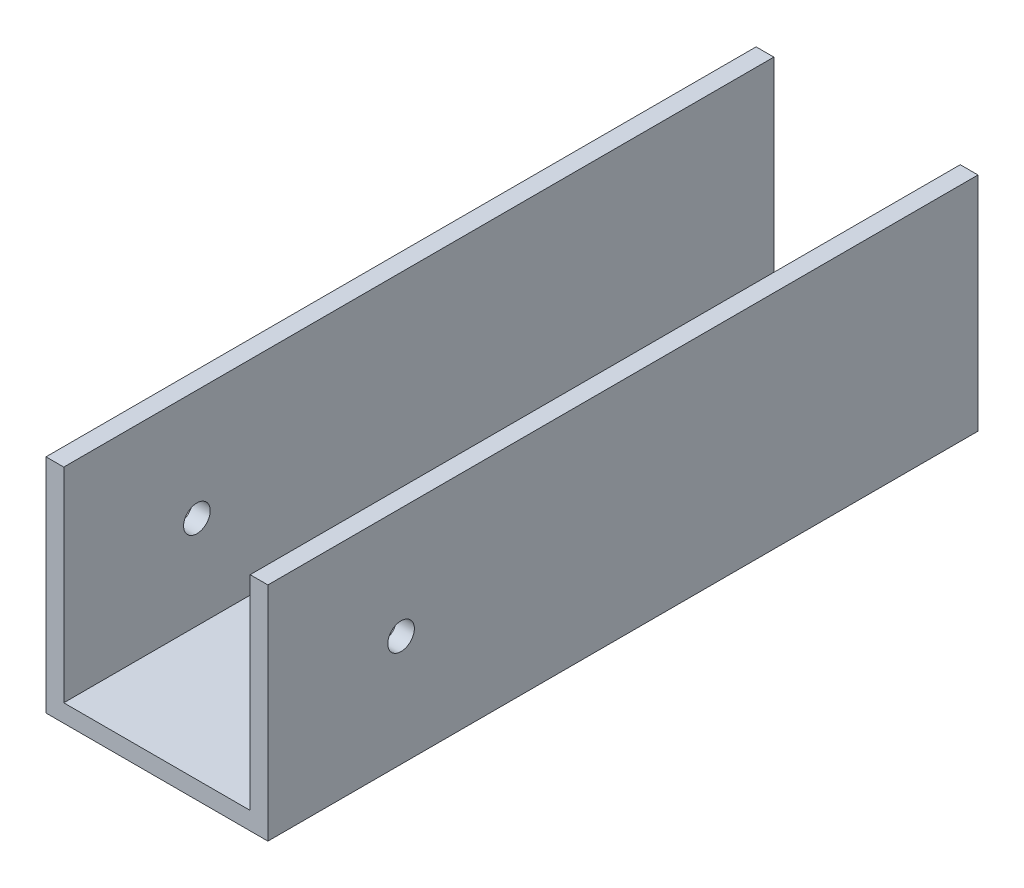
ISO-10303-21;
HEADER;
FILE_DESCRIPTION(('STEP AP214'),'2;1');
FILE_NAME('part.step','',(''),(''),'','','');
FILE_SCHEMA(('AUTOMOTIVE_DESIGN { 1 0 10303 214 1 1 1 1 }'));
ENDSEC;
DATA;
#1=APPLICATION_CONTEXT('core data for automotive mechanical design processes');
#2=APPLICATION_PROTOCOL_DEFINITION('international standard','automotive_design',2000,#1);
#3=PRODUCT_CONTEXT('',#1,'mechanical');
#4=PRODUCT('Part','Part','',(#3));
#5=PRODUCT_RELATED_PRODUCT_CATEGORY('part','',(#4));
#6=PRODUCT_DEFINITION_FORMATION('','',#4);
#7=PRODUCT_DEFINITION_CONTEXT('part definition',#1,'design');
#8=PRODUCT_DEFINITION('design','',#6,#7);
#9=PRODUCT_DEFINITION_SHAPE('','',#8);
#10=(LENGTH_UNIT() NAMED_UNIT(*) SI_UNIT(.MILLI.,.METRE.));
#11=(NAMED_UNIT(*) PLANE_ANGLE_UNIT() SI_UNIT($,.RADIAN.));
#12=(NAMED_UNIT(*) SI_UNIT($,.STERADIAN.) SOLID_ANGLE_UNIT());
#13=UNCERTAINTY_MEASURE_WITH_UNIT(LENGTH_MEASURE(1.E-05),#10,'distance_accuracy_value','');
#14=(GEOMETRIC_REPRESENTATION_CONTEXT(3) GLOBAL_UNCERTAINTY_ASSIGNED_CONTEXT((#13)) GLOBAL_UNIT_ASSIGNED_CONTEXT((#10,
#11,#12)) REPRESENTATION_CONTEXT('',''));
#15=CARTESIAN_POINT('',(0.,0.,0.));
#16=DIRECTION('',(0.,0.,1.));
#17=DIRECTION('',(1.,0.,0.));
#18=AXIS2_PLACEMENT_3D('',#15,#16,#17);
#19=CARTESIAN_POINT('',(0.,0.,80.));
#20=DIRECTION('',(1.,0.,0.));
#21=DIRECTION('',(0.,0.,-1.));
#22=AXIS2_PLACEMENT_3D('',#19,#20,#21);
#23=PLANE('',#22);
#24=CARTESIAN_POINT('',(0.,12.5,65.));
#25=DIRECTION('',(1.,0.,0.));
#26=DIRECTION('',(0.,0.,-1.));
#27=AXIS2_PLACEMENT_3D('',#24,#25,#26);
#28=CIRCLE('',#27,1.5);
#29=CARTESIAN_POINT('',(0.,12.5,63.5));
#30=VERTEX_POINT('',#29);
#31=EDGE_CURVE('E180',#30,#30,#28,.F.);
#32=ORIENTED_EDGE('',*,*,#31,.F.);
#33=EDGE_LOOP('',(#32));
#34=FACE_BOUND('',#33,.T.);
#35=DIRECTION('',(0.,-1.,0.));
#36=VECTOR('',#35,1.);
#37=CARTESIAN_POINT('',(0.,0.,0.));
#38=LINE('',#37,#36);
#39=CARTESIAN_POINT('',(0.,25.,0.));
#40=VERTEX_POINT('',#39);
#41=CARTESIAN_POINT('',(0.,0.,0.));
#42=VERTEX_POINT('',#41);
#43=EDGE_CURVE('E129',#40,#42,#38,.T.);
#44=ORIENTED_EDGE('',*,*,#43,.T.);
#45=DIRECTION('',(0.,0.,-1.));
#46=VECTOR('',#45,1.);
#47=CARTESIAN_POINT('',(0.,0.,80.));
#48=LINE('',#47,#46);
#49=CARTESIAN_POINT('',(0.,0.,80.));
#50=VERTEX_POINT('',#49);
#51=EDGE_CURVE('E11',#50,#42,#48,.T.);
#52=ORIENTED_EDGE('',*,*,#51,.F.);
#53=DIRECTION('',(0.,-1.,0.));
#54=VECTOR('',#53,1.);
#55=CARTESIAN_POINT('',(0.,0.,80.));
#56=LINE('',#55,#54);
#57=CARTESIAN_POINT('',(0.,25.,80.));
#58=VERTEX_POINT('',#57);
#59=EDGE_CURVE('E144',#58,#50,#56,.T.);
#60=ORIENTED_EDGE('',*,*,#59,.F.);
#61=DIRECTION('',(0.,0.,-1.));
#62=VECTOR('',#61,1.);
#63=CARTESIAN_POINT('',(0.,25.,80.));
#64=LINE('',#63,#62);
#65=EDGE_CURVE('E125',#58,#40,#64,.T.);
#66=ORIENTED_EDGE('',*,*,#65,.T.);
#67=EDGE_LOOP('',(#44,#52,#60,#66));
#68=FACE_BOUND('',#67,.T.);
#69=ADVANCED_FACE('F32',(#34,#68),#23,.F.);
#70=CARTESIAN_POINT('',(0.,0.,80.));
#71=DIRECTION('',(0.,1.,0.));
#72=DIRECTION('',(0.,0.,1.));
#73=AXIS2_PLACEMENT_3D('',#70,#71,#72);
#74=PLANE('',#73);
#75=CARTESIAN_POINT('',(12.5,0.,20.));
#76=DIRECTION('',(0.,-1.,0.));
#77=DIRECTION('',(0.,0.,1.));
#78=AXIS2_PLACEMENT_3D('',#75,#76,#77);
#79=CIRCLE('',#78,3.);
#80=CARTESIAN_POINT('',(12.5,0.,23.));
#81=VERTEX_POINT('',#80);
#82=EDGE_CURVE('E195',#81,#81,#79,.T.);
#83=ORIENTED_EDGE('',*,*,#82,.F.);
#84=EDGE_LOOP('',(#83));
#85=FACE_BOUND('',#84,.T.);
#86=CARTESIAN_POINT('',(12.5,0.,60.));
#87=DIRECTION('',(0.,-1.,0.));
#88=DIRECTION('',(0.,0.,-1.));
#89=AXIS2_PLACEMENT_3D('',#86,#87,#88);
#90=CIRCLE('',#89,3.);
#91=CARTESIAN_POINT('',(12.5,0.,57.));
#92=VERTEX_POINT('',#91);
#93=EDGE_CURVE('E189',#92,#92,#90,.T.);
#94=ORIENTED_EDGE('',*,*,#93,.F.);
#95=EDGE_LOOP('',(#94));
#96=FACE_BOUND('',#95,.T.);
#97=DIRECTION('',(1.,0.,0.));
#98=VECTOR('',#97,1.);
#99=CARTESIAN_POINT('',(0.,0.,0.));
#100=LINE('',#99,#98);
#101=CARTESIAN_POINT('',(25.,0.,0.));
#102=VERTEX_POINT('',#101);
#103=EDGE_CURVE('E132',#42,#102,#100,.T.);
#104=ORIENTED_EDGE('',*,*,#103,.T.);
#105=DIRECTION('',(0.,0.,-1.));
#106=VECTOR('',#105,1.);
#107=CARTESIAN_POINT('',(25.,0.,80.));
#108=LINE('',#107,#106);
#109=CARTESIAN_POINT('',(25.,0.,80.));
#110=VERTEX_POINT('',#109);
#111=EDGE_CURVE('E41',#110,#102,#108,.T.);
#112=ORIENTED_EDGE('',*,*,#111,.F.);
#113=DIRECTION('',(1.,0.,0.));
#114=VECTOR('',#113,1.);
#115=CARTESIAN_POINT('',(0.,0.,80.));
#116=LINE('',#115,#114);
#117=EDGE_CURVE('E92',#50,#110,#116,.T.);
#118=ORIENTED_EDGE('',*,*,#117,.F.);
#119=ORIENTED_EDGE('',*,*,#51,.T.);
#120=EDGE_LOOP('',(#104,#112,#118,#119));
#121=FACE_BOUND('',#120,.T.);
#122=ADVANCED_FACE('F202',(#85,#96,#121),#74,.F.);
#123=CARTESIAN_POINT('',(25.,0.,80.));
#124=DIRECTION('',(-1.,0.,0.));
#125=DIRECTION('',(0.,0.,1.));
#126=AXIS2_PLACEMENT_3D('',#123,#124,#125);
#127=PLANE('',#126);
#128=CARTESIAN_POINT('',(25.,12.5,65.));
#129=DIRECTION('',(1.,0.,0.));
#130=DIRECTION('',(0.,0.,-1.));
#131=AXIS2_PLACEMENT_3D('',#128,#129,#130);
#132=CIRCLE('',#131,1.5);
#133=CARTESIAN_POINT('',(25.,12.5,63.5));
#134=VERTEX_POINT('',#133);
#135=EDGE_CURVE('E183',#134,#134,#132,.T.);
#136=ORIENTED_EDGE('',*,*,#135,.F.);
#137=EDGE_LOOP('',(#136));
#138=FACE_BOUND('',#137,.T.);
#139=DIRECTION('',(0.,1.,0.));
#140=VECTOR('',#139,1.);
#141=CARTESIAN_POINT('',(25.,0.,0.));
#142=LINE('',#141,#140);
#143=CARTESIAN_POINT('',(25.,25.,0.));
#144=VERTEX_POINT('',#143);
#145=EDGE_CURVE('E135',#102,#144,#142,.T.);
#146=ORIENTED_EDGE('',*,*,#145,.T.);
#147=DIRECTION('',(0.,0.,-1.));
#148=VECTOR('',#147,1.);
#149=CARTESIAN_POINT('',(25.,25.,80.));
#150=LINE('',#149,#148);
#151=CARTESIAN_POINT('',(25.,25.,80.));
#152=VERTEX_POINT('',#151);
#153=EDGE_CURVE('E151',#152,#144,#150,.T.);
#154=ORIENTED_EDGE('',*,*,#153,.F.);
#155=DIRECTION('',(0.,1.,0.));
#156=VECTOR('',#155,1.);
#157=CARTESIAN_POINT('',(25.,0.,80.));
#158=LINE('',#157,#156);
#159=EDGE_CURVE('E160',#110,#152,#158,.T.);
#160=ORIENTED_EDGE('',*,*,#159,.F.);
#161=ORIENTED_EDGE('',*,*,#111,.T.);
#162=EDGE_LOOP('',(#146,#154,#160,#161));
#163=FACE_BOUND('',#162,.T.);
#164=ADVANCED_FACE('F158',(#138,#163),#127,.F.);
#165=CARTESIAN_POINT('',(23.,25.,80.));
#166=DIRECTION('',(0.,-1.,0.));
#167=DIRECTION('',(0.,0.,-1.));
#168=AXIS2_PLACEMENT_3D('',#165,#166,#167);
#169=PLANE('',#168);
#170=DIRECTION('',(-1.,0.,0.));
#171=VECTOR('',#170,1.);
#172=CARTESIAN_POINT('',(23.,25.,0.));
#173=LINE('',#172,#171);
#174=CARTESIAN_POINT('',(23.,25.,0.));
#175=VERTEX_POINT('',#174);
#176=EDGE_CURVE('E137',#144,#175,#173,.T.);
#177=ORIENTED_EDGE('',*,*,#176,.T.);
#178=DIRECTION('',(0.,0.,-1.));
#179=VECTOR('',#178,1.);
#180=CARTESIAN_POINT('',(23.,25.,80.));
#181=LINE('',#180,#179);
#182=CARTESIAN_POINT('',(23.,25.,80.));
#183=VERTEX_POINT('',#182);
#184=EDGE_CURVE('E148',#183,#175,#181,.T.);
#185=ORIENTED_EDGE('',*,*,#184,.F.);
#186=DIRECTION('',(-1.,0.,0.));
#187=VECTOR('',#186,1.);
#188=CARTESIAN_POINT('',(23.,25.,80.));
#189=LINE('',#188,#187);
#190=EDGE_CURVE('E172',#152,#183,#189,.T.);
#191=ORIENTED_EDGE('',*,*,#190,.F.);
#192=ORIENTED_EDGE('',*,*,#153,.T.);
#193=EDGE_LOOP('',(#177,#185,#191,#192));
#194=FACE_BOUND('',#193,.T.);
#195=ADVANCED_FACE('F168',(#194),#169,.F.);
#196=CARTESIAN_POINT('',(23.,25.,80.));
#197=DIRECTION('',(1.,0.,0.));
#198=DIRECTION('',(0.,0.,-1.));
#199=AXIS2_PLACEMENT_3D('',#196,#197,#198);
#200=PLANE('',#199);
#201=CARTESIAN_POINT('',(23.,12.5,65.));
#202=DIRECTION('',(1.,0.,0.));
#203=DIRECTION('',(0.,0.,-1.));
#204=AXIS2_PLACEMENT_3D('',#201,#202,#203);
#205=CIRCLE('',#204,1.5);
#206=CARTESIAN_POINT('',(23.,12.5,63.5));
#207=VERTEX_POINT('',#206);
#208=EDGE_CURVE('E133',#207,#207,#205,.T.);
#209=ORIENTED_EDGE('',*,*,#208,.T.);
#210=EDGE_LOOP('',(#209));
#211=FACE_BOUND('',#210,.T.);
#212=DIRECTION('',(0.,-1.,0.));
#213=VECTOR('',#212,1.);
#214=CARTESIAN_POINT('',(23.,25.,0.));
#215=LINE('',#214,#213);
#216=CARTESIAN_POINT('',(23.,2.,0.));
#217=VERTEX_POINT('',#216);
#218=EDGE_CURVE('E139',#175,#217,#215,.T.);
#219=ORIENTED_EDGE('',*,*,#218,.T.);
#220=DIRECTION('',(0.,0.,-1.));
#221=VECTOR('',#220,1.);
#222=CARTESIAN_POINT('',(23.,2.,80.));
#223=LINE('',#222,#221);
#224=CARTESIAN_POINT('',(23.,2.,80.));
#225=VERTEX_POINT('',#224);
#226=EDGE_CURVE('E120',#225,#217,#223,.T.);
#227=ORIENTED_EDGE('',*,*,#226,.F.);
#228=DIRECTION('',(0.,-1.,0.));
#229=VECTOR('',#228,1.);
#230=CARTESIAN_POINT('',(23.,25.,80.));
#231=LINE('',#230,#229);
#232=EDGE_CURVE('E111',#183,#225,#231,.T.);
#233=ORIENTED_EDGE('',*,*,#232,.F.);
#234=ORIENTED_EDGE('',*,*,#184,.T.);
#235=EDGE_LOOP('',(#219,#227,#233,#234));
#236=FACE_BOUND('',#235,.T.);
#237=ADVANCED_FACE('F171',(#211,#236),#200,.F.);
#238=CARTESIAN_POINT('',(2.,2.,80.));
#239=DIRECTION('',(0.,-1.,0.));
#240=DIRECTION('',(0.,0.,-1.));
#241=AXIS2_PLACEMENT_3D('',#238,#239,#240);
#242=PLANE('',#241);
#243=CARTESIAN_POINT('',(12.5,2.,20.));
#244=DIRECTION('',(0.,-1.,0.));
#245=DIRECTION('',(0.,0.,-1.));
#246=AXIS2_PLACEMENT_3D('',#243,#244,#245);
#247=CIRCLE('',#246,3.);
#248=CARTESIAN_POINT('',(12.5,2.,17.));
#249=VERTEX_POINT('',#248);
#250=EDGE_CURVE('E192',#249,#249,#247,.F.);
#251=ORIENTED_EDGE('',*,*,#250,.F.);
#252=EDGE_LOOP('',(#251));
#253=FACE_BOUND('',#252,.T.);
#254=CARTESIAN_POINT('',(12.5,2.,60.));
#255=DIRECTION('',(0.,-1.,0.));
#256=DIRECTION('',(0.,0.,-1.));
#257=AXIS2_PLACEMENT_3D('',#254,#255,#256);
#258=CIRCLE('',#257,3.);
#259=CARTESIAN_POINT('',(12.5,2.,57.));
#260=VERTEX_POINT('',#259);
#261=EDGE_CURVE('E186',#260,#260,#258,.F.);
#262=ORIENTED_EDGE('',*,*,#261,.F.);
#263=EDGE_LOOP('',(#262));
#264=FACE_BOUND('',#263,.T.);
#265=DIRECTION('',(-1.,0.,0.));
#266=VECTOR('',#265,1.);
#267=CARTESIAN_POINT('',(2.,2.,0.));
#268=LINE('',#267,#266);
#269=CARTESIAN_POINT('',(2.,2.,0.));
#270=VERTEX_POINT('',#269);
#271=EDGE_CURVE('E119',#217,#270,#268,.T.);
#272=ORIENTED_EDGE('',*,*,#271,.T.);
#273=DIRECTION('',(0.,0.,-1.));
#274=VECTOR('',#273,1.);
#275=CARTESIAN_POINT('',(2.,2.,80.));
#276=LINE('',#275,#274);
#277=CARTESIAN_POINT('',(2.,2.,80.));
#278=VERTEX_POINT('',#277);
#279=EDGE_CURVE('E116',#278,#270,#276,.T.);
#280=ORIENTED_EDGE('',*,*,#279,.F.);
#281=DIRECTION('',(-1.,0.,0.));
#282=VECTOR('',#281,1.);
#283=CARTESIAN_POINT('',(2.,2.,80.));
#284=LINE('',#283,#282);
#285=EDGE_CURVE('E105',#225,#278,#284,.T.);
#286=ORIENTED_EDGE('',*,*,#285,.F.);
#287=ORIENTED_EDGE('',*,*,#226,.T.);
#288=EDGE_LOOP('',(#272,#280,#286,#287));
#289=FACE_BOUND('',#288,.T.);
#290=ADVANCED_FACE('F117',(#253,#264,#289),#242,.F.);
#291=CARTESIAN_POINT('',(2.,25.,80.));
#292=DIRECTION('',(-1.,0.,0.));
#293=DIRECTION('',(0.,-1.,0.));
#294=AXIS2_PLACEMENT_3D('',#291,#292,#293);
#295=PLANE('',#294);
#296=CARTESIAN_POINT('',(2.,12.5,65.));
#297=DIRECTION('',(-1.,0.,0.));
#298=DIRECTION('',(0.,-1.,0.));
#299=AXIS2_PLACEMENT_3D('',#296,#297,#298);
#300=CIRCLE('',#299,1.5);
#301=CARTESIAN_POINT('',(2.,11.,65.));
#302=VERTEX_POINT('',#301);
#303=EDGE_CURVE('E35',#302,#302,#300,.T.);
#304=ORIENTED_EDGE('',*,*,#303,.T.);
#305=EDGE_LOOP('',(#304));
#306=FACE_BOUND('',#305,.T.);
#307=DIRECTION('',(0.,1.,0.));
#308=VECTOR('',#307,1.);
#309=CARTESIAN_POINT('',(2.,25.,0.));
#310=LINE('',#309,#308);
#311=CARTESIAN_POINT('',(2.,25.,0.));
#312=VERTEX_POINT('',#311);
#313=EDGE_CURVE('E78',#270,#312,#310,.T.);
#314=ORIENTED_EDGE('',*,*,#313,.T.);
#315=DIRECTION('',(0.,0.,-1.));
#316=VECTOR('',#315,1.);
#317=CARTESIAN_POINT('',(2.,25.,80.));
#318=LINE('',#317,#316);
#319=CARTESIAN_POINT('',(2.,25.,80.));
#320=VERTEX_POINT('',#319);
#321=EDGE_CURVE('E121',#320,#312,#318,.T.);
#322=ORIENTED_EDGE('',*,*,#321,.F.);
#323=DIRECTION('',(0.,1.,0.));
#324=VECTOR('',#323,1.);
#325=CARTESIAN_POINT('',(2.,25.,80.));
#326=LINE('',#325,#324);
#327=EDGE_CURVE('E109',#278,#320,#326,.T.);
#328=ORIENTED_EDGE('',*,*,#327,.F.);
#329=ORIENTED_EDGE('',*,*,#279,.T.);
#330=EDGE_LOOP('',(#314,#322,#328,#329));
#331=FACE_BOUND('',#330,.T.);
#332=ADVANCED_FACE('F123',(#306,#331),#295,.F.);
#333=CARTESIAN_POINT('',(0.,25.,80.));
#334=DIRECTION('',(0.,-1.,0.));
#335=DIRECTION('',(0.,0.,-1.));
#336=AXIS2_PLACEMENT_3D('',#333,#334,#335);
#337=PLANE('',#336);
#338=DIRECTION('',(-1.,0.,0.));
#339=VECTOR('',#338,1.);
#340=CARTESIAN_POINT('',(0.,25.,0.));
#341=LINE('',#340,#339);
#342=EDGE_CURVE('E84',#312,#40,#341,.T.);
#343=ORIENTED_EDGE('',*,*,#342,.T.);
#344=ORIENTED_EDGE('',*,*,#65,.F.);
#345=DIRECTION('',(-1.,0.,0.));
#346=VECTOR('',#345,1.);
#347=CARTESIAN_POINT('',(0.,25.,80.));
#348=LINE('',#347,#346);
#349=EDGE_CURVE('E49',#320,#58,#348,.T.);
#350=ORIENTED_EDGE('',*,*,#349,.F.);
#351=ORIENTED_EDGE('',*,*,#321,.T.);
#352=EDGE_LOOP('',(#343,#344,#350,#351));
#353=FACE_BOUND('',#352,.T.);
#354=ADVANCED_FACE('F209',(#353),#337,.F.);
#355=CARTESIAN_POINT('',(0.,0.,80.));
#356=DIRECTION('',(0.,0.,-1.));
#357=DIRECTION('',(-1.,0.,0.));
#358=AXIS2_PLACEMENT_3D('',#355,#356,#357);
#359=PLANE('',#358);
#360=ORIENTED_EDGE('',*,*,#59,.T.);
#361=ORIENTED_EDGE('',*,*,#117,.T.);
#362=ORIENTED_EDGE('',*,*,#159,.T.);
#363=ORIENTED_EDGE('',*,*,#190,.T.);
#364=ORIENTED_EDGE('',*,*,#232,.T.);
#365=ORIENTED_EDGE('',*,*,#285,.T.);
#366=ORIENTED_EDGE('',*,*,#327,.T.);
#367=ORIENTED_EDGE('',*,*,#349,.T.);
#368=EDGE_LOOP('',(#360,#361,#362,#363,#364,#365,#366,#367));
#369=FACE_BOUND('',#368,.T.);
#370=ADVANCED_FACE('F107',(#369),#359,.F.);
#371=CARTESIAN_POINT('',(0.,0.,0.));
#372=DIRECTION('',(0.,0.,-1.));
#373=DIRECTION('',(-1.,0.,0.));
#374=AXIS2_PLACEMENT_3D('',#371,#372,#373);
#375=PLANE('',#374);
#376=ORIENTED_EDGE('',*,*,#43,.F.);
#377=ORIENTED_EDGE('',*,*,#342,.F.);
#378=ORIENTED_EDGE('',*,*,#313,.F.);
#379=ORIENTED_EDGE('',*,*,#271,.F.);
#380=ORIENTED_EDGE('',*,*,#218,.F.);
#381=ORIENTED_EDGE('',*,*,#176,.F.);
#382=ORIENTED_EDGE('',*,*,#145,.F.);
#383=ORIENTED_EDGE('',*,*,#103,.F.);
#384=EDGE_LOOP('',(#376,#377,#378,#379,#380,#381,#382,#383));
#385=FACE_BOUND('',#384,.T.);
#386=ADVANCED_FACE('F164',(#385),#375,.T.);
#387=CARTESIAN_POINT('',(-4.24264068711928,12.5,65.));
#388=DIRECTION('',(1.,0.,0.));
#389=DIRECTION('',(0.,0.,-1.));
#390=AXIS2_PLACEMENT_3D('',#387,#388,#389);
#391=CYLINDRICAL_SURFACE('',#390,1.5);
#392=ORIENTED_EDGE('',*,*,#31,.T.);
#393=EDGE_LOOP('',(#392));
#394=FACE_BOUND('',#393,.T.);
#395=ORIENTED_EDGE('',*,*,#303,.F.);
#396=EDGE_LOOP('',(#395));
#397=FACE_BOUND('',#396,.T.);
#398=ADVANCED_FACE('F226',(#394,#397),#391,.F.);
#399=ORIENTED_EDGE('',*,*,#135,.T.);
#400=EDGE_LOOP('',(#399));
#401=FACE_BOUND('',#400,.T.);
#402=ORIENTED_EDGE('',*,*,#208,.F.);
#403=EDGE_LOOP('',(#402));
#404=FACE_BOUND('',#403,.T.);
#405=ADVANCED_FACE('F229',(#401,#404),#391,.F.);
#406=CARTESIAN_POINT('',(12.5,25.001,60.));
#407=DIRECTION('',(0.,-1.,0.));
#408=DIRECTION('',(0.,0.,-1.));
#409=AXIS2_PLACEMENT_3D('',#406,#407,#408);
#410=CYLINDRICAL_SURFACE('',#409,3.);
#411=ORIENTED_EDGE('',*,*,#93,.T.);
#412=EDGE_LOOP('',(#411));
#413=FACE_BOUND('',#412,.T.);
#414=ORIENTED_EDGE('',*,*,#261,.T.);
#415=EDGE_LOOP('',(#414));
#416=FACE_BOUND('',#415,.T.);
#417=ADVANCED_FACE('F237',(#413,#416),#410,.F.);
#418=CARTESIAN_POINT('',(12.5,25.001,20.));
#419=DIRECTION('',(0.,-1.,0.));
#420=DIRECTION('',(0.,0.,-1.));
#421=AXIS2_PLACEMENT_3D('',#418,#419,#420);
#422=CYLINDRICAL_SURFACE('',#421,3.);
#423=ORIENTED_EDGE('',*,*,#82,.T.);
#424=EDGE_LOOP('',(#423));
#425=FACE_BOUND('',#424,.T.);
#426=ORIENTED_EDGE('',*,*,#250,.T.);
#427=EDGE_LOOP('',(#426));
#428=FACE_BOUND('',#427,.T.);
#429=ADVANCED_FACE('F199',(#425,#428),#422,.F.);
#430=CLOSED_SHELL('',(#69,#122,#164,#195,#237,#290,#332,#354,#370,#386,#398,#405,#417,#429));
#431=MANIFOLD_SOLID_BREP('B2',#430);
#432=ADVANCED_BREP_SHAPE_REPRESENTATION('',(#18,#431),#14);
#433=SHAPE_DEFINITION_REPRESENTATION(#9,#432);
ENDSEC;
END-ISO-10303-21;
